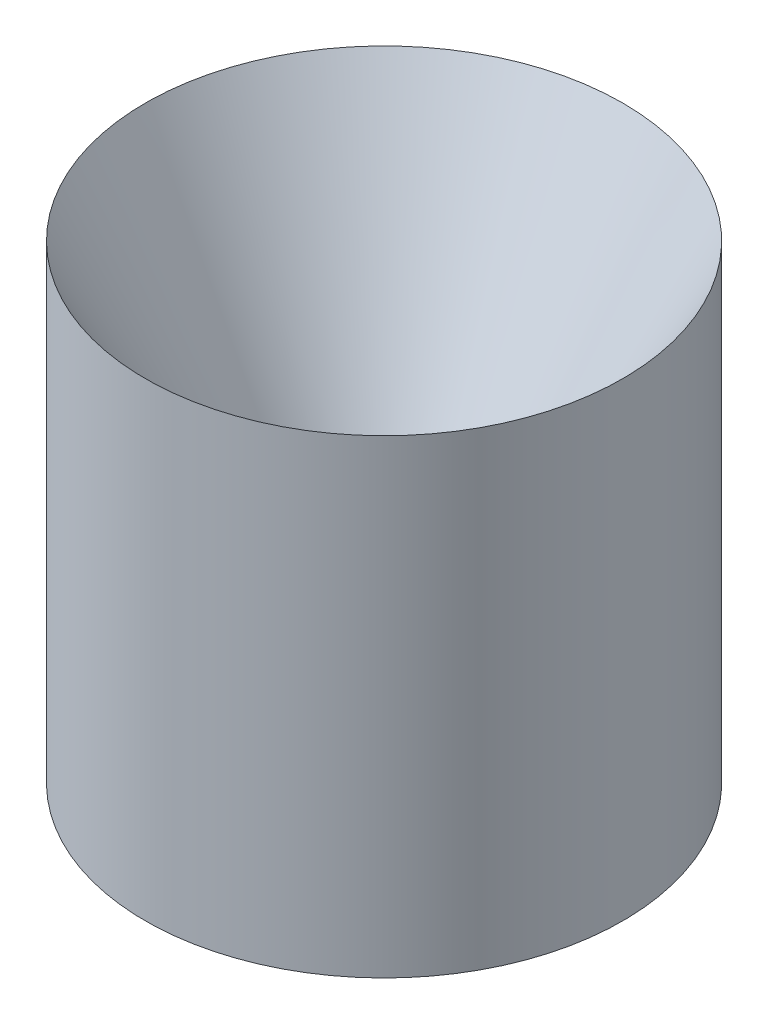
ISO-10303-21;
HEADER;
FILE_DESCRIPTION(('STEP AP214'),'2;1');
FILE_NAME('part.step','',(''),(''),'','','');
FILE_SCHEMA(('AUTOMOTIVE_DESIGN { 1 0 10303 214 1 1 1 1 }'));
ENDSEC;
DATA;
#1=APPLICATION_CONTEXT('core data for automotive mechanical design processes');
#2=APPLICATION_PROTOCOL_DEFINITION('international standard','automotive_design',2000,#1);
#3=PRODUCT_CONTEXT('',#1,'mechanical');
#4=PRODUCT('Part','Part','',(#3));
#5=PRODUCT_RELATED_PRODUCT_CATEGORY('part','',(#4));
#6=PRODUCT_DEFINITION_FORMATION('','',#4);
#7=PRODUCT_DEFINITION_CONTEXT('part definition',#1,'design');
#8=PRODUCT_DEFINITION('design','',#6,#7);
#9=PRODUCT_DEFINITION_SHAPE('','',#8);
#10=(LENGTH_UNIT() NAMED_UNIT(*) SI_UNIT(.MILLI.,.METRE.));
#11=(NAMED_UNIT(*) PLANE_ANGLE_UNIT() SI_UNIT($,.RADIAN.));
#12=(NAMED_UNIT(*) SI_UNIT($,.STERADIAN.) SOLID_ANGLE_UNIT());
#13=UNCERTAINTY_MEASURE_WITH_UNIT(LENGTH_MEASURE(1.E-05),#10,'distance_accuracy_value','');
#14=(GEOMETRIC_REPRESENTATION_CONTEXT(3) GLOBAL_UNCERTAINTY_ASSIGNED_CONTEXT((#13)) GLOBAL_UNIT_ASSIGNED_CONTEXT((#10,
#11,#12)) REPRESENTATION_CONTEXT('',''));
#15=CARTESIAN_POINT('',(0.,0.,0.));
#16=DIRECTION('',(0.,0.,1.));
#17=DIRECTION('',(1.,0.,0.));
#18=AXIS2_PLACEMENT_3D('',#15,#16,#17);
#19=CARTESIAN_POINT('',(-1.07197865167885E-07,-4.27609336828283E-12,0.));
#20=DIRECTION('',(0.,-1.,0.));
#21=DIRECTION('',(0.,0.,-1.));
#22=AXIS2_PLACEMENT_3D('',#19,#20,#21);
#23=CYLINDRICAL_SURFACE('',#22,38.7349998928021);
#24=CARTESIAN_POINT('',(-1.07197865167885E-07,0.,0.));
#25=DIRECTION('',(0.,-1.,0.));
#26=DIRECTION('',(0.,0.,-1.));
#27=AXIS2_PLACEMENT_3D('',#24,#25,#26);
#28=CIRCLE('',#27,38.7349998928021);
#29=CARTESIAN_POINT('',(-1.07197865167885E-07,0.,-38.7349998928021));
#30=VERTEX_POINT('',#29);
#31=EDGE_CURVE('E53',#30,#30,#28,.T.);
#32=ORIENTED_EDGE('',*,*,#31,.F.);
#33=EDGE_LOOP('',(#32));
#34=FACE_BOUND('',#33,.T.);
#35=CARTESIAN_POINT('',(-1.07197865167885E-07,76.2,0.));
#36=DIRECTION('',(0.,-1.,0.));
#37=DIRECTION('',(0.,0.,-1.));
#38=AXIS2_PLACEMENT_3D('',#35,#36,#37);
#39=CIRCLE('',#38,38.7349998928021);
#40=CARTESIAN_POINT('',(-1.07197865167885E-07,76.2,-38.7349998928021));
#41=VERTEX_POINT('',#40);
#42=EDGE_CURVE('E10',#41,#41,#39,.T.);
#43=ORIENTED_EDGE('',*,*,#42,.T.);
#44=EDGE_LOOP('',(#43));
#45=FACE_BOUND('',#44,.T.);
#46=ADVANCED_FACE('F34',(#34,#45),#23,.T.);
#47=CARTESIAN_POINT('',(-1.07197865167885E-07,15.2801891767836,0.));
#48=DIRECTION('',(0.,1.,0.));
#49=DIRECTION('',(0.,0.,1.));
#50=AXIS2_PLACEMENT_3D('',#47,#48,#49);
#51=CONICAL_SURFACE('',#50,6.5793874,0.485666901061695);
#52=ORIENTED_EDGE('',*,*,#42,.F.);
#53=EDGE_LOOP('',(#52));
#54=FACE_BOUND('',#53,.T.);
#55=CARTESIAN_POINT('',(-1.07197865167885E-07,15.2801891767836,0.));
#56=DIRECTION('',(0.,-1.,0.));
#57=DIRECTION('',(0.,0.,-1.));
#58=AXIS2_PLACEMENT_3D('',#55,#56,#57);
#59=CIRCLE('',#58,6.5793874);
#60=CARTESIAN_POINT('',(-1.07197865167885E-07,15.2801891767836,-6.5793874));
#61=VERTEX_POINT('',#60);
#62=EDGE_CURVE('E40',#61,#61,#59,.T.);
#63=ORIENTED_EDGE('',*,*,#62,.T.);
#64=EDGE_LOOP('',(#63));
#65=FACE_BOUND('',#64,.T.);
#66=ADVANCED_FACE('F60',(#54,#65),#51,.F.);
#67=CARTESIAN_POINT('',(-13.335,15.2801891767836,0.));
#68=DIRECTION('',(0.,1.,0.));
#69=DIRECTION('',(0.,0.,1.));
#70=AXIS2_PLACEMENT_3D('',#67,#68,#69);
#71=PLANE('',#70);
#72=ORIENTED_EDGE('',*,*,#62,.F.);
#73=EDGE_LOOP('',(#72));
#74=FACE_BOUND('',#73,.T.);
#75=CARTESIAN_POINT('',(-1.07197865167885E-07,15.2801891767836,0.));
#76=DIRECTION('',(0.,-1.,0.));
#77=DIRECTION('',(0.,0.,-1.));
#78=AXIS2_PLACEMENT_3D('',#75,#76,#77);
#79=CIRCLE('',#78,13.3349998928021);
#80=CARTESIAN_POINT('',(-1.07197865167885E-07,15.2801891767836,-13.3349998928021));
#81=VERTEX_POINT('',#80);
#82=EDGE_CURVE('E44',#81,#81,#79,.T.);
#83=ORIENTED_EDGE('',*,*,#82,.T.);
#84=EDGE_LOOP('',(#83));
#85=FACE_BOUND('',#84,.T.);
#86=ADVANCED_FACE('F64',(#74,#85),#71,.F.);
#87=CARTESIAN_POINT('',(-1.07197865167885E-07,-4.27609336828283E-12,0.));
#88=DIRECTION('',(0.,-1.,0.));
#89=DIRECTION('',(0.,0.,-1.));
#90=AXIS2_PLACEMENT_3D('',#87,#88,#89);
#91=CYLINDRICAL_SURFACE('',#90,13.3349998928021);
#92=ORIENTED_EDGE('',*,*,#82,.F.);
#93=EDGE_LOOP('',(#92));
#94=FACE_BOUND('',#93,.T.);
#95=CARTESIAN_POINT('',(-1.07197865167885E-07,0.,0.));
#96=DIRECTION('',(0.,-1.,0.));
#97=DIRECTION('',(0.,0.,-1.));
#98=AXIS2_PLACEMENT_3D('',#95,#96,#97);
#99=CIRCLE('',#98,13.3349998928021);
#100=CARTESIAN_POINT('',(-1.07197865167885E-07,0.,-13.3349998928021));
#101=VERTEX_POINT('',#100);
#102=EDGE_CURVE('E48',#101,#101,#99,.T.);
#103=ORIENTED_EDGE('',*,*,#102,.T.);
#104=EDGE_LOOP('',(#103));
#105=FACE_BOUND('',#104,.T.);
#106=ADVANCED_FACE('F69',(#94,#105),#91,.F.);
#107=CARTESIAN_POINT('',(-13.335,0.,0.));
#108=DIRECTION('',(0.,1.,0.));
#109=DIRECTION('',(0.,0.,1.));
#110=AXIS2_PLACEMENT_3D('',#107,#108,#109);
#111=PLANE('',#110);
#112=ORIENTED_EDGE('',*,*,#102,.F.);
#113=EDGE_LOOP('',(#112));
#114=FACE_BOUND('',#113,.T.);
#115=ORIENTED_EDGE('',*,*,#31,.T.);
#116=EDGE_LOOP('',(#115));
#117=FACE_BOUND('',#116,.T.);
#118=ADVANCED_FACE('F57',(#114,#117),#111,.F.);
#119=CLOSED_SHELL('',(#46,#66,#86,#106,#118));
#120=MANIFOLD_SOLID_BREP('B2',#119);
#121=ADVANCED_BREP_SHAPE_REPRESENTATION('',(#18,#120),#14);
#122=SHAPE_DEFINITION_REPRESENTATION(#9,#121);
ENDSEC;
END-ISO-10303-21;
